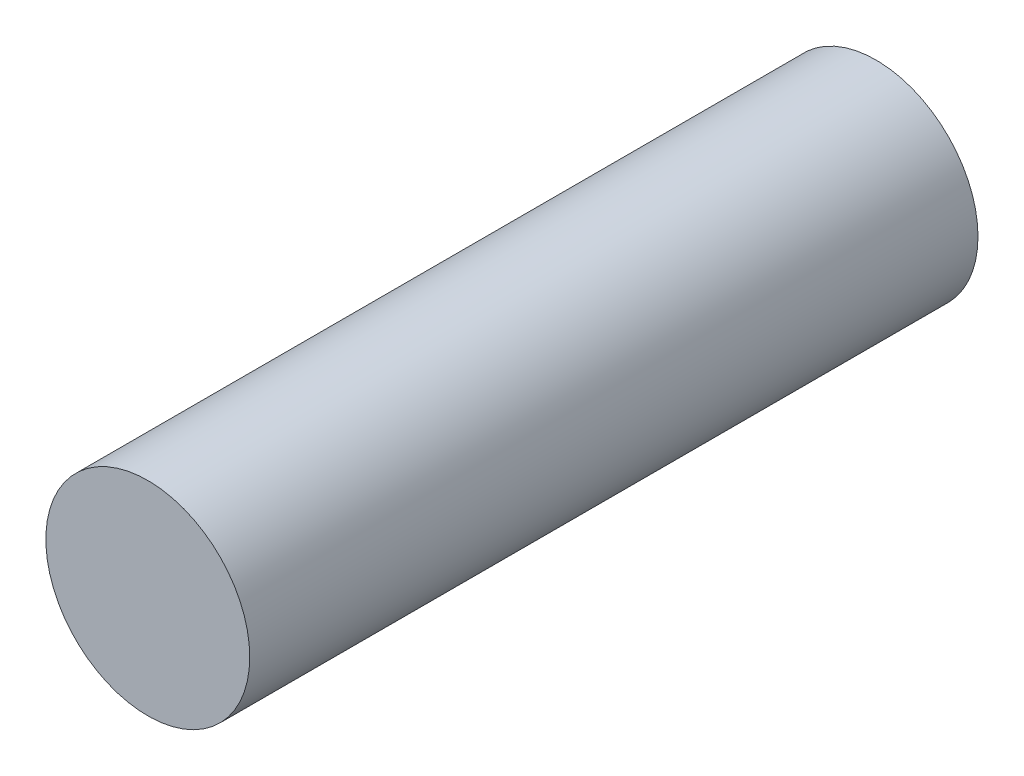
ISO-10303-21;
HEADER;
FILE_DESCRIPTION(('STEP AP214'),'2;1');
FILE_NAME('part.step','',(''),(''),'','','');
FILE_SCHEMA(('AUTOMOTIVE_DESIGN { 1 0 10303 214 1 1 1 1 }'));
ENDSEC;
DATA;
#1=APPLICATION_CONTEXT('core data for automotive mechanical design processes');
#2=APPLICATION_PROTOCOL_DEFINITION('international standard','automotive_design',2000,#1);
#3=PRODUCT_CONTEXT('',#1,'mechanical');
#4=PRODUCT('Part','Part','',(#3));
#5=PRODUCT_RELATED_PRODUCT_CATEGORY('part','',(#4));
#6=PRODUCT_DEFINITION_FORMATION('','',#4);
#7=PRODUCT_DEFINITION_CONTEXT('part definition',#1,'design');
#8=PRODUCT_DEFINITION('design','',#6,#7);
#9=PRODUCT_DEFINITION_SHAPE('','',#8);
#10=(LENGTH_UNIT() NAMED_UNIT(*) SI_UNIT(.MILLI.,.METRE.));
#11=(NAMED_UNIT(*) PLANE_ANGLE_UNIT() SI_UNIT($,.RADIAN.));
#12=(NAMED_UNIT(*) SI_UNIT($,.STERADIAN.) SOLID_ANGLE_UNIT());
#13=UNCERTAINTY_MEASURE_WITH_UNIT(LENGTH_MEASURE(1.E-05),#10,'distance_accuracy_value','');
#14=(GEOMETRIC_REPRESENTATION_CONTEXT(3) GLOBAL_UNCERTAINTY_ASSIGNED_CONTEXT((#13)) GLOBAL_UNIT_ASSIGNED_CONTEXT((#10,
#11,#12)) REPRESENTATION_CONTEXT('',''));
#15=CARTESIAN_POINT('',(0.,0.,0.));
#16=DIRECTION('',(0.,0.,1.));
#17=DIRECTION('',(1.,0.,0.));
#18=AXIS2_PLACEMENT_3D('',#15,#16,#17);
#19=CARTESIAN_POINT('',(0.,0.,14.));
#20=DIRECTION('',(0.,0.,-1.));
#21=DIRECTION('',(-1.,0.,0.));
#22=AXIS2_PLACEMENT_3D('',#19,#20,#21);
#23=CYLINDRICAL_SURFACE('',#22,1.96);
#24=CARTESIAN_POINT('',(0.,0.,14.));
#25=DIRECTION('',(0.,0.,1.));
#26=DIRECTION('',(1.,0.,0.));
#27=AXIS2_PLACEMENT_3D('',#24,#25,#26);
#28=CIRCLE('',#27,1.96);
#29=CARTESIAN_POINT('',(1.96,0.,14.));
#30=VERTEX_POINT('',#29);
#31=EDGE_CURVE('E10',#30,#30,#28,.T.);
#32=ORIENTED_EDGE('',*,*,#31,.F.);
#33=EDGE_LOOP('',(#32));
#34=FACE_BOUND('',#33,.T.);
#35=CARTESIAN_POINT('',(0.,0.,0.));
#36=DIRECTION('',(0.,0.,1.));
#37=DIRECTION('',(1.,0.,0.));
#38=AXIS2_PLACEMENT_3D('',#35,#36,#37);
#39=CIRCLE('',#38,1.96);
#40=CARTESIAN_POINT('',(1.96,0.,0.));
#41=VERTEX_POINT('',#40);
#42=EDGE_CURVE('E36',#41,#41,#39,.T.);
#43=ORIENTED_EDGE('',*,*,#42,.T.);
#44=EDGE_LOOP('',(#43));
#45=FACE_BOUND('',#44,.T.);
#46=ADVANCED_FACE('F33',(#34,#45),#23,.T.);
#47=CARTESIAN_POINT('',(0.,0.,14.));
#48=DIRECTION('',(0.,0.,1.));
#49=DIRECTION('',(1.,0.,0.));
#50=AXIS2_PLACEMENT_3D('',#47,#48,#49);
#51=PLANE('',#50);
#52=ORIENTED_EDGE('',*,*,#31,.T.);
#53=EDGE_LOOP('',(#52));
#54=FACE_BOUND('',#53,.T.);
#55=ADVANCED_FACE('F48',(#54),#51,.T.);
#56=CARTESIAN_POINT('',(0.,0.,0.));
#57=DIRECTION('',(0.,0.,1.));
#58=DIRECTION('',(1.,0.,0.));
#59=AXIS2_PLACEMENT_3D('',#56,#57,#58);
#60=PLANE('',#59);
#61=ORIENTED_EDGE('',*,*,#42,.F.);
#62=EDGE_LOOP('',(#61));
#63=FACE_BOUND('',#62,.T.);
#64=ADVANCED_FACE('F46',(#63),#60,.F.);
#65=CLOSED_SHELL('',(#46,#55,#64));
#66=MANIFOLD_SOLID_BREP('B2',#65);
#67=ADVANCED_BREP_SHAPE_REPRESENTATION('',(#18,#66),#14);
#68=SHAPE_DEFINITION_REPRESENTATION(#9,#67);
ENDSEC;
END-ISO-10303-21;
